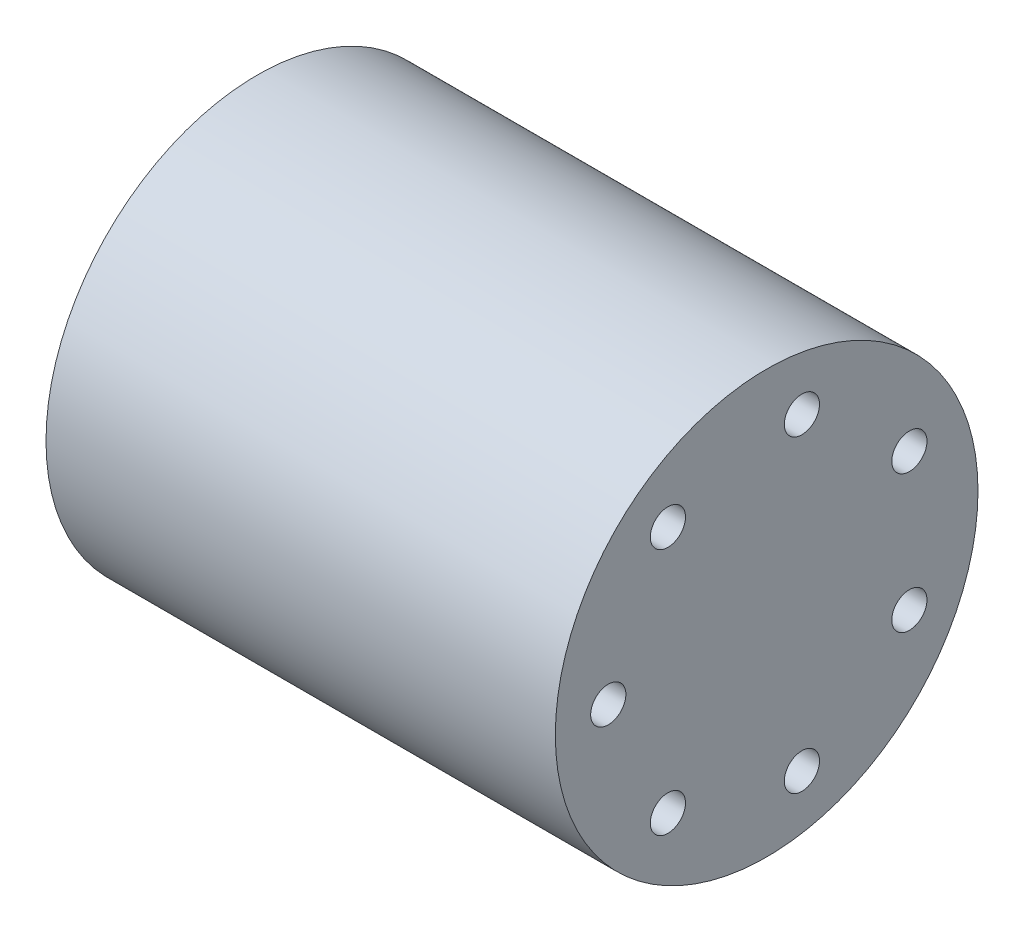
ISO-10303-21;
HEADER;
FILE_DESCRIPTION(('STEP AP214'),'2;1');
FILE_NAME('part.step','',(''),(''),'','','');
FILE_SCHEMA(('AUTOMOTIVE_DESIGN { 1 0 10303 214 1 1 1 1 }'));
ENDSEC;
DATA;
#1=APPLICATION_CONTEXT('core data for automotive mechanical design processes');
#2=APPLICATION_PROTOCOL_DEFINITION('international standard','automotive_design',2000,#1);
#3=PRODUCT_CONTEXT('',#1,'mechanical');
#4=PRODUCT('Part','Part','',(#3));
#5=PRODUCT_RELATED_PRODUCT_CATEGORY('part','',(#4));
#6=PRODUCT_DEFINITION_FORMATION('','',#4);
#7=PRODUCT_DEFINITION_CONTEXT('part definition',#1,'design');
#8=PRODUCT_DEFINITION('design','',#6,#7);
#9=PRODUCT_DEFINITION_SHAPE('','',#8);
#10=(LENGTH_UNIT() NAMED_UNIT(*) SI_UNIT(.MILLI.,.METRE.));
#11=(NAMED_UNIT(*) PLANE_ANGLE_UNIT() SI_UNIT($,.RADIAN.));
#12=(NAMED_UNIT(*) SI_UNIT($,.STERADIAN.) SOLID_ANGLE_UNIT());
#13=UNCERTAINTY_MEASURE_WITH_UNIT(LENGTH_MEASURE(1.E-05),#10,'distance_accuracy_value','');
#14=(GEOMETRIC_REPRESENTATION_CONTEXT(3) GLOBAL_UNCERTAINTY_ASSIGNED_CONTEXT((#13)) GLOBAL_UNIT_ASSIGNED_CONTEXT((#10,
#11,#12)) REPRESENTATION_CONTEXT('',''));
#15=CARTESIAN_POINT('',(0.,0.,0.));
#16=DIRECTION('',(0.,0.,1.));
#17=DIRECTION('',(1.,0.,0.));
#18=AXIS2_PLACEMENT_3D('',#15,#16,#17);
#19=CARTESIAN_POINT('',(6.0875,0.,0.));
#20=DIRECTION('',(1.,0.,0.));
#21=DIRECTION('',(0.,1.,0.));
#22=AXIS2_PLACEMENT_3D('',#19,#20,#21);
#23=PLANE('',#22);
#24=CARTESIAN_POINT('',(6.0875,-10.9679390120455,-2.50336050700853));
#25=DIRECTION('',(1.,0.,0.));
#26=DIRECTION('',(0.,0.,-1.));
#27=AXIS2_PLACEMENT_3D('',#24,#25,#26);
#28=CIRCLE('',#27,1.25);
#29=CARTESIAN_POINT('',(6.0875,-10.9679390120455,-3.75336050700853));
#30=VERTEX_POINT('',#29);
#31=EDGE_CURVE('E11',#30,#30,#28,.T.);
#32=ORIENTED_EDGE('',*,*,#31,.T.);
#33=EDGE_LOOP('',(#32));
#34=FACE_BOUND('',#33,.T.);
#35=ADVANCED_FACE('F16',(#34),#23,.T.);
#36=CARTESIAN_POINT('',(6.0875,-10.9679390120455,-2.50336050700853));
#37=DIRECTION('',(1.,0.,0.));
#38=DIRECTION('',(0.,0.,-1.));
#39=AXIS2_PLACEMENT_3D('',#36,#37,#38);
#40=CYLINDRICAL_SURFACE('',#39,1.25);
#41=CARTESIAN_POINT('',(18.0875,-10.9679390120455,-2.50336050700853));
#42=DIRECTION('',(1.,0.,0.));
#43=DIRECTION('',(0.,0.,-1.));
#44=AXIS2_PLACEMENT_3D('',#41,#42,#43);
#45=CIRCLE('',#44,1.25);
#46=CARTESIAN_POINT('',(18.0875,-10.9679390120455,-3.75336050700853));
#47=VERTEX_POINT('',#46);
#48=EDGE_CURVE('E20',#47,#47,#45,.T.);
#49=ORIENTED_EDGE('',*,*,#48,.T.);
#50=EDGE_LOOP('',(#49));
#51=FACE_BOUND('',#50,.T.);
#52=ORIENTED_EDGE('',*,*,#31,.F.);
#53=EDGE_LOOP('',(#52));
#54=FACE_BOUND('',#53,.T.);
#55=ADVANCED_FACE('F223',(#51,#54),#40,.F.);
#56=CARTESIAN_POINT('',(6.0875,0.,0.));
#57=DIRECTION('',(1.,0.,0.));
#58=DIRECTION('',(0.,1.,0.));
#59=AXIS2_PLACEMENT_3D('',#56,#57,#58);
#60=PLANE('',#59);
#61=CARTESIAN_POINT('',(6.0875,-4.88119206507253,-10.1358997639022));
#62=DIRECTION('',(1.,0.,0.));
#63=DIRECTION('',(0.,0.,-1.));
#64=AXIS2_PLACEMENT_3D('',#61,#62,#63);
#65=CIRCLE('',#64,1.25);
#66=CARTESIAN_POINT('',(6.0875,-4.88119206507253,-11.3858997639022));
#67=VERTEX_POINT('',#66);
#68=EDGE_CURVE('E27',#67,#67,#65,.T.);
#69=ORIENTED_EDGE('',*,*,#68,.T.);
#70=EDGE_LOOP('',(#69));
#71=FACE_BOUND('',#70,.T.);
#72=ADVANCED_FACE('F251',(#71),#60,.T.);
#73=CARTESIAN_POINT('',(6.0875,-4.88119206507253,-10.1358997639022));
#74=DIRECTION('',(1.,0.,0.));
#75=DIRECTION('',(0.,0.,-1.));
#76=AXIS2_PLACEMENT_3D('',#73,#74,#75);
#77=CYLINDRICAL_SURFACE('',#76,1.25);
#78=CARTESIAN_POINT('',(18.0875,-4.88119206507253,-10.1358997639022));
#79=DIRECTION('',(1.,0.,0.));
#80=DIRECTION('',(0.,0.,-1.));
#81=AXIS2_PLACEMENT_3D('',#78,#79,#80);
#82=CIRCLE('',#81,1.25);
#83=CARTESIAN_POINT('',(18.0875,-4.88119206507253,-11.3858997639022));
#84=VERTEX_POINT('',#83);
#85=EDGE_CURVE('E193',#84,#84,#82,.T.);
#86=ORIENTED_EDGE('',*,*,#85,.T.);
#87=EDGE_LOOP('',(#86));
#88=FACE_BOUND('',#87,.T.);
#89=ORIENTED_EDGE('',*,*,#68,.F.);
#90=EDGE_LOOP('',(#89));
#91=FACE_BOUND('',#90,.T.);
#92=ADVANCED_FACE('F280',(#88,#91),#77,.F.);
#93=CARTESIAN_POINT('',(6.0875,0.,0.));
#94=DIRECTION('',(1.,0.,0.));
#95=DIRECTION('',(0.,1.,0.));
#96=AXIS2_PLACEMENT_3D('',#93,#94,#95);
#97=PLANE('',#96);
#98=CARTESIAN_POINT('',(6.0875,4.88119206507253,-10.1358997639022));
#99=DIRECTION('',(1.,0.,0.));
#100=DIRECTION('',(0.,0.,-1.));
#101=AXIS2_PLACEMENT_3D('',#98,#99,#100);
#102=CIRCLE('',#101,1.25);
#103=CARTESIAN_POINT('',(6.0875,4.88119206507253,-11.3858997639022));
#104=VERTEX_POINT('',#103);
#105=EDGE_CURVE('E151',#104,#104,#102,.T.);
#106=ORIENTED_EDGE('',*,*,#105,.T.);
#107=EDGE_LOOP('',(#106));
#108=FACE_BOUND('',#107,.T.);
#109=ADVANCED_FACE('F301',(#108),#97,.T.);
#110=CARTESIAN_POINT('',(6.0875,4.88119206507253,-10.1358997639022));
#111=DIRECTION('',(1.,0.,0.));
#112=DIRECTION('',(0.,0.,-1.));
#113=AXIS2_PLACEMENT_3D('',#110,#111,#112);
#114=CYLINDRICAL_SURFACE('',#113,1.25);
#115=CARTESIAN_POINT('',(18.0875,4.88119206507253,-10.1358997639022));
#116=DIRECTION('',(1.,0.,0.));
#117=DIRECTION('',(0.,0.,-1.));
#118=AXIS2_PLACEMENT_3D('',#115,#116,#117);
#119=CIRCLE('',#118,1.25);
#120=CARTESIAN_POINT('',(18.0875,4.88119206507253,-11.3858997639022));
#121=VERTEX_POINT('',#120);
#122=EDGE_CURVE('E181',#121,#121,#119,.T.);
#123=ORIENTED_EDGE('',*,*,#122,.T.);
#124=EDGE_LOOP('',(#123));
#125=FACE_BOUND('',#124,.T.);
#126=ORIENTED_EDGE('',*,*,#105,.F.);
#127=EDGE_LOOP('',(#126));
#128=FACE_BOUND('',#127,.T.);
#129=ADVANCED_FACE('F259',(#125,#128),#114,.F.);
#130=CARTESIAN_POINT('',(6.0875,0.,0.));
#131=DIRECTION('',(1.,0.,0.));
#132=DIRECTION('',(0.,1.,0.));
#133=AXIS2_PLACEMENT_3D('',#130,#131,#132);
#134=PLANE('',#133);
#135=CARTESIAN_POINT('',(6.0875,10.9679390120455,-2.50336050700854));
#136=DIRECTION('',(1.,0.,0.));
#137=DIRECTION('',(0.,0.,-1.));
#138=AXIS2_PLACEMENT_3D('',#135,#136,#137);
#139=CIRCLE('',#138,1.25);
#140=CARTESIAN_POINT('',(6.0875,10.9679390120455,-3.75336050700854));
#141=VERTEX_POINT('',#140);
#142=EDGE_CURVE('E72',#141,#141,#139,.T.);
#143=ORIENTED_EDGE('',*,*,#142,.T.);
#144=EDGE_LOOP('',(#143));
#145=FACE_BOUND('',#144,.T.);
#146=ADVANCED_FACE('F255',(#145),#134,.T.);
#147=CARTESIAN_POINT('',(6.0875,10.9679390120455,-2.50336050700854));
#148=DIRECTION('',(1.,0.,0.));
#149=DIRECTION('',(0.,0.,-1.));
#150=AXIS2_PLACEMENT_3D('',#147,#148,#149);
#151=CYLINDRICAL_SURFACE('',#150,1.25);
#152=CARTESIAN_POINT('',(18.0875,10.9679390120455,-2.50336050700854));
#153=DIRECTION('',(1.,0.,0.));
#154=DIRECTION('',(0.,0.,-1.));
#155=AXIS2_PLACEMENT_3D('',#152,#153,#154);
#156=CIRCLE('',#155,1.25);
#157=CARTESIAN_POINT('',(18.0875,10.9679390120455,-3.75336050700854));
#158=VERTEX_POINT('',#157);
#159=EDGE_CURVE('E132',#158,#158,#156,.T.);
#160=ORIENTED_EDGE('',*,*,#159,.T.);
#161=EDGE_LOOP('',(#160));
#162=FACE_BOUND('',#161,.T.);
#163=ORIENTED_EDGE('',*,*,#142,.F.);
#164=EDGE_LOOP('',(#163));
#165=FACE_BOUND('',#164,.T.);
#166=ADVANCED_FACE('F258',(#162,#165),#151,.F.);
#167=CARTESIAN_POINT('',(6.0875,0.,0.));
#168=DIRECTION('',(1.,0.,0.));
#169=DIRECTION('',(0.,1.,0.));
#170=AXIS2_PLACEMENT_3D('',#167,#168,#169);
#171=PLANE('',#170);
#172=CARTESIAN_POINT('',(6.0875,8.79560417776534,7.01426027091075));
#173=DIRECTION('',(1.,0.,0.));
#174=DIRECTION('',(0.,0.,-1.));
#175=AXIS2_PLACEMENT_3D('',#172,#173,#174);
#176=CIRCLE('',#175,1.25);
#177=CARTESIAN_POINT('',(6.0875,8.79560417776534,5.76426027091075));
#178=VERTEX_POINT('',#177);
#179=EDGE_CURVE('E78',#178,#178,#176,.T.);
#180=ORIENTED_EDGE('',*,*,#179,.T.);
#181=EDGE_LOOP('',(#180));
#182=FACE_BOUND('',#181,.T.);
#183=ADVANCED_FACE('F18',(#182),#171,.T.);
#184=CARTESIAN_POINT('',(6.0875,8.79560417776534,7.01426027091075));
#185=DIRECTION('',(1.,0.,0.));
#186=DIRECTION('',(0.,0.,-1.));
#187=AXIS2_PLACEMENT_3D('',#184,#185,#186);
#188=CYLINDRICAL_SURFACE('',#187,1.25);
#189=CARTESIAN_POINT('',(18.0875,8.79560417776534,7.01426027091075));
#190=DIRECTION('',(1.,0.,0.));
#191=DIRECTION('',(0.,0.,-1.));
#192=AXIS2_PLACEMENT_3D('',#189,#190,#191);
#193=CIRCLE('',#192,1.25);
#194=CARTESIAN_POINT('',(18.0875,8.79560417776534,5.76426027091075));
#195=VERTEX_POINT('',#194);
#196=EDGE_CURVE('E123',#195,#195,#193,.T.);
#197=ORIENTED_EDGE('',*,*,#196,.T.);
#198=EDGE_LOOP('',(#197));
#199=FACE_BOUND('',#198,.T.);
#200=ORIENTED_EDGE('',*,*,#179,.F.);
#201=EDGE_LOOP('',(#200));
#202=FACE_BOUND('',#201,.T.);
#203=ADVANCED_FACE('F298',(#199,#202),#188,.F.);
#204=CARTESIAN_POINT('',(6.0875,0.,0.));
#205=DIRECTION('',(1.,0.,0.));
#206=DIRECTION('',(0.,1.,0.));
#207=AXIS2_PLACEMENT_3D('',#204,#205,#206);
#208=PLANE('',#207);
#209=CARTESIAN_POINT('',(6.0875,0.,11.25));
#210=DIRECTION('',(1.,0.,0.));
#211=DIRECTION('',(0.,0.,-1.));
#212=AXIS2_PLACEMENT_3D('',#209,#210,#211);
#213=CIRCLE('',#212,1.25);
#214=CARTESIAN_POINT('',(6.0875,0.,10.));
#215=VERTEX_POINT('',#214);
#216=EDGE_CURVE('E87',#215,#215,#213,.T.);
#217=ORIENTED_EDGE('',*,*,#216,.T.);
#218=EDGE_LOOP('',(#217));
#219=FACE_BOUND('',#218,.T.);
#220=ADVANCED_FACE('F295',(#219),#208,.T.);
#221=CARTESIAN_POINT('',(6.0875,0.,11.25));
#222=DIRECTION('',(1.,0.,0.));
#223=DIRECTION('',(0.,0.,-1.));
#224=AXIS2_PLACEMENT_3D('',#221,#222,#223);
#225=CYLINDRICAL_SURFACE('',#224,1.25);
#226=CARTESIAN_POINT('',(18.0875,0.,11.25));
#227=DIRECTION('',(1.,0.,0.));
#228=DIRECTION('',(0.,0.,-1.));
#229=AXIS2_PLACEMENT_3D('',#226,#227,#228);
#230=CIRCLE('',#229,1.25);
#231=CARTESIAN_POINT('',(18.0875,0.,10.));
#232=VERTEX_POINT('',#231);
#233=EDGE_CURVE('E118',#232,#232,#230,.T.);
#234=ORIENTED_EDGE('',*,*,#233,.T.);
#235=EDGE_LOOP('',(#234));
#236=FACE_BOUND('',#235,.T.);
#237=ORIENTED_EDGE('',*,*,#216,.F.);
#238=EDGE_LOOP('',(#237));
#239=FACE_BOUND('',#238,.T.);
#240=ADVANCED_FACE('F119',(#236,#239),#225,.F.);
#241=CARTESIAN_POINT('',(6.0875,0.,0.));
#242=DIRECTION('',(1.,0.,0.));
#243=DIRECTION('',(0.,1.,0.));
#244=AXIS2_PLACEMENT_3D('',#241,#242,#243);
#245=PLANE('',#244);
#246=CARTESIAN_POINT('',(6.0875,-8.79560417776534,7.01426027091075));
#247=DIRECTION('',(1.,0.,0.));
#248=DIRECTION('',(0.,0.,-1.));
#249=AXIS2_PLACEMENT_3D('',#246,#247,#248);
#250=CIRCLE('',#249,1.25);
#251=CARTESIAN_POINT('',(6.0875,-8.79560417776534,5.76426027091075));
#252=VERTEX_POINT('',#251);
#253=EDGE_CURVE('E129',#252,#252,#250,.T.);
#254=ORIENTED_EDGE('',*,*,#253,.T.);
#255=EDGE_LOOP('',(#254));
#256=FACE_BOUND('',#255,.T.);
#257=ADVANCED_FACE('F277',(#256),#245,.T.);
#258=CARTESIAN_POINT('',(6.0875,-8.79560417776534,7.01426027091075));
#259=DIRECTION('',(1.,0.,0.));
#260=DIRECTION('',(0.,0.,-1.));
#261=AXIS2_PLACEMENT_3D('',#258,#259,#260);
#262=CYLINDRICAL_SURFACE('',#261,1.25);
#263=CARTESIAN_POINT('',(18.0875,-8.79560417776534,7.01426027091075));
#264=DIRECTION('',(1.,0.,0.));
#265=DIRECTION('',(0.,0.,-1.));
#266=AXIS2_PLACEMENT_3D('',#263,#264,#265);
#267=CIRCLE('',#266,1.25);
#268=CARTESIAN_POINT('',(18.0875,-8.79560417776534,5.76426027091075));
#269=VERTEX_POINT('',#268);
#270=EDGE_CURVE('E112',#269,#269,#267,.T.);
#271=ORIENTED_EDGE('',*,*,#270,.T.);
#272=EDGE_LOOP('',(#271));
#273=FACE_BOUND('',#272,.T.);
#274=ORIENTED_EDGE('',*,*,#253,.F.);
#275=EDGE_LOOP('',(#274));
#276=FACE_BOUND('',#275,.T.);
#277=ADVANCED_FACE('F241',(#273,#276),#262,.F.);
#278=CARTESIAN_POINT('',(-18.0875,0.,0.));
#279=DIRECTION('',(1.,0.,0.));
#280=DIRECTION('',(0.,1.,0.));
#281=AXIS2_PLACEMENT_3D('',#278,#279,#280);
#282=PLANE('',#281);
#283=CARTESIAN_POINT('',(-18.0875,0.,0.));
#284=DIRECTION('',(1.,0.,0.));
#285=DIRECTION('',(0.,0.,-1.));
#286=AXIS2_PLACEMENT_3D('',#283,#284,#285);
#287=CIRCLE('',#286,15.01);
#288=CARTESIAN_POINT('',(-18.0875,0.,-15.01));
#289=VERTEX_POINT('',#288);
#290=EDGE_CURVE('E203',#289,#289,#287,.T.);
#291=ORIENTED_EDGE('',*,*,#290,.F.);
#292=EDGE_LOOP('',(#291));
#293=FACE_BOUND('',#292,.T.);
#294=CARTESIAN_POINT('',(-18.0875,-10.9679390120455,-2.50336050700853));
#295=DIRECTION('',(1.,0.,0.));
#296=DIRECTION('',(0.,0.,-1.));
#297=AXIS2_PLACEMENT_3D('',#294,#295,#296);
#298=CIRCLE('',#297,1.25);
#299=CARTESIAN_POINT('',(-18.0875,-10.9679390120455,-3.75336050700853));
#300=VERTEX_POINT('',#299);
#301=EDGE_CURVE('E188',#300,#300,#298,.T.);
#302=ORIENTED_EDGE('',*,*,#301,.T.);
#303=EDGE_LOOP('',(#302));
#304=FACE_BOUND('',#303,.T.);
#305=CARTESIAN_POINT('',(-18.0875,-4.88119206507253,-10.1358997639022));
#306=DIRECTION('',(1.,0.,0.));
#307=DIRECTION('',(0.,0.,-1.));
#308=AXIS2_PLACEMENT_3D('',#305,#306,#307);
#309=CIRCLE('',#308,1.25);
#310=CARTESIAN_POINT('',(-18.0875,-4.88119206507253,-11.3858997639022));
#311=VERTEX_POINT('',#310);
#312=EDGE_CURVE('E164',#311,#311,#309,.T.);
#313=ORIENTED_EDGE('',*,*,#312,.T.);
#314=EDGE_LOOP('',(#313));
#315=FACE_BOUND('',#314,.T.);
#316=CARTESIAN_POINT('',(-18.0875,4.88119206507253,-10.1358997639022));
#317=DIRECTION('',(1.,0.,0.));
#318=DIRECTION('',(0.,0.,-1.));
#319=AXIS2_PLACEMENT_3D('',#316,#317,#318);
#320=CIRCLE('',#319,1.25);
#321=CARTESIAN_POINT('',(-18.0875,4.88119206507253,-11.3858997639022));
#322=VERTEX_POINT('',#321);
#323=EDGE_CURVE('E182',#322,#322,#320,.T.);
#324=ORIENTED_EDGE('',*,*,#323,.T.);
#325=EDGE_LOOP('',(#324));
#326=FACE_BOUND('',#325,.T.);
#327=CARTESIAN_POINT('',(-18.0875,10.9679390120455,-2.50336050700854));
#328=DIRECTION('',(1.,0.,0.));
#329=DIRECTION('',(0.,0.,-1.));
#330=AXIS2_PLACEMENT_3D('',#327,#328,#329);
#331=CIRCLE('',#330,1.25);
#332=CARTESIAN_POINT('',(-18.0875,10.9679390120455,-3.75336050700854));
#333=VERTEX_POINT('',#332);
#334=EDGE_CURVE('E156',#333,#333,#331,.T.);
#335=ORIENTED_EDGE('',*,*,#334,.T.);
#336=EDGE_LOOP('',(#335));
#337=FACE_BOUND('',#336,.T.);
#338=CARTESIAN_POINT('',(-18.0875,8.79560417776534,7.01426027091075));
#339=DIRECTION('',(1.,0.,0.));
#340=DIRECTION('',(0.,0.,-1.));
#341=AXIS2_PLACEMENT_3D('',#338,#339,#340);
#342=CIRCLE('',#341,1.25);
#343=CARTESIAN_POINT('',(-18.0875,8.79560417776534,5.76426027091075));
#344=VERTEX_POINT('',#343);
#345=EDGE_CURVE('E155',#344,#344,#342,.T.);
#346=ORIENTED_EDGE('',*,*,#345,.T.);
#347=EDGE_LOOP('',(#346));
#348=FACE_BOUND('',#347,.T.);
#349=CARTESIAN_POINT('',(-18.0875,0.,11.25));
#350=DIRECTION('',(1.,0.,0.));
#351=DIRECTION('',(0.,0.,-1.));
#352=AXIS2_PLACEMENT_3D('',#349,#350,#351);
#353=CIRCLE('',#352,1.25);
#354=CARTESIAN_POINT('',(-18.0875,0.,10.));
#355=VERTEX_POINT('',#354);
#356=EDGE_CURVE('E144',#355,#355,#353,.T.);
#357=ORIENTED_EDGE('',*,*,#356,.T.);
#358=EDGE_LOOP('',(#357));
#359=FACE_BOUND('',#358,.T.);
#360=CARTESIAN_POINT('',(-18.0875,-8.79560417776534,7.01426027091075));
#361=DIRECTION('',(1.,0.,0.));
#362=DIRECTION('',(0.,0.,-1.));
#363=AXIS2_PLACEMENT_3D('',#360,#361,#362);
#364=CIRCLE('',#363,1.25);
#365=CARTESIAN_POINT('',(-18.0875,-8.79560417776534,5.76426027091075));
#366=VERTEX_POINT('',#365);
#367=EDGE_CURVE('E143',#366,#366,#364,.T.);
#368=ORIENTED_EDGE('',*,*,#367,.T.);
#369=EDGE_LOOP('',(#368));
#370=FACE_BOUND('',#369,.T.);
#371=ADVANCED_FACE('F232',(#293,#304,#315,#326,#337,#348,#359,#370),#282,.F.);
#372=CARTESIAN_POINT('',(18.0875,0.,0.));
#373=DIRECTION('',(1.,0.,0.));
#374=DIRECTION('',(0.,1.,0.));
#375=AXIS2_PLACEMENT_3D('',#372,#373,#374);
#376=PLANE('',#375);
#377=CARTESIAN_POINT('',(18.0875,0.,0.));
#378=DIRECTION('',(1.,0.,0.));
#379=DIRECTION('',(0.,0.,-1.));
#380=AXIS2_PLACEMENT_3D('',#377,#378,#379);
#381=CIRCLE('',#380,15.01);
#382=CARTESIAN_POINT('',(18.0875,0.,-15.01));
#383=VERTEX_POINT('',#382);
#384=EDGE_CURVE('E177',#383,#383,#381,.T.);
#385=ORIENTED_EDGE('',*,*,#384,.T.);
#386=EDGE_LOOP('',(#385));
#387=FACE_BOUND('',#386,.T.);
#388=ORIENTED_EDGE('',*,*,#270,.F.);
#389=EDGE_LOOP('',(#388));
#390=FACE_BOUND('',#389,.T.);
#391=ORIENTED_EDGE('',*,*,#233,.F.);
#392=EDGE_LOOP('',(#391));
#393=FACE_BOUND('',#392,.T.);
#394=ORIENTED_EDGE('',*,*,#196,.F.);
#395=EDGE_LOOP('',(#394));
#396=FACE_BOUND('',#395,.T.);
#397=ORIENTED_EDGE('',*,*,#159,.F.);
#398=EDGE_LOOP('',(#397));
#399=FACE_BOUND('',#398,.T.);
#400=ORIENTED_EDGE('',*,*,#122,.F.);
#401=EDGE_LOOP('',(#400));
#402=FACE_BOUND('',#401,.T.);
#403=ORIENTED_EDGE('',*,*,#85,.F.);
#404=EDGE_LOOP('',(#403));
#405=FACE_BOUND('',#404,.T.);
#406=ORIENTED_EDGE('',*,*,#48,.F.);
#407=EDGE_LOOP('',(#406));
#408=FACE_BOUND('',#407,.T.);
#409=ADVANCED_FACE('F229',(#387,#390,#393,#396,#399,#402,#405,#408),#376,.T.);
#410=CARTESIAN_POINT('',(18.0875,0.,0.));
#411=DIRECTION('',(-1.,0.,0.));
#412=DIRECTION('',(0.,0.,1.));
#413=AXIS2_PLACEMENT_3D('',#410,#411,#412);
#414=CYLINDRICAL_SURFACE('',#413,15.01);
#415=ORIENTED_EDGE('',*,*,#290,.T.);
#416=EDGE_LOOP('',(#415));
#417=FACE_BOUND('',#416,.T.);
#418=ORIENTED_EDGE('',*,*,#384,.F.);
#419=EDGE_LOOP('',(#418));
#420=FACE_BOUND('',#419,.T.);
#421=ADVANCED_FACE('F231',(#417,#420),#414,.T.);
#422=CARTESIAN_POINT('',(-6.0875,0.,0.));
#423=DIRECTION('',(-1.,0.,0.));
#424=DIRECTION('',(0.,0.,1.));
#425=AXIS2_PLACEMENT_3D('',#422,#423,#424);
#426=PLANE('',#425);
#427=CARTESIAN_POINT('',(-6.0875,-8.79560417776534,7.01426027091075));
#428=DIRECTION('',(1.,0.,0.));
#429=DIRECTION('',(0.,0.,-1.));
#430=AXIS2_PLACEMENT_3D('',#427,#428,#429);
#431=CIRCLE('',#430,1.25);
#432=CARTESIAN_POINT('',(-6.0875,-8.79560417776534,5.76426027091075));
#433=VERTEX_POINT('',#432);
#434=EDGE_CURVE('E139',#433,#433,#431,.T.);
#435=ORIENTED_EDGE('',*,*,#434,.F.);
#436=EDGE_LOOP('',(#435));
#437=FACE_BOUND('',#436,.T.);
#438=ADVANCED_FACE('F239',(#437),#426,.T.);
#439=CARTESIAN_POINT('',(-6.0875,-8.79560417776534,7.01426027091075));
#440=DIRECTION('',(-1.,0.,0.));
#441=DIRECTION('',(0.,0.,-1.));
#442=AXIS2_PLACEMENT_3D('',#439,#440,#441);
#443=CYLINDRICAL_SURFACE('',#442,1.25);
#444=ORIENTED_EDGE('',*,*,#367,.F.);
#445=EDGE_LOOP('',(#444));
#446=FACE_BOUND('',#445,.T.);
#447=ORIENTED_EDGE('',*,*,#434,.T.);
#448=EDGE_LOOP('',(#447));
#449=FACE_BOUND('',#448,.T.);
#450=ADVANCED_FACE('F263',(#446,#449),#443,.F.);
#451=CARTESIAN_POINT('',(-6.0875,0.,0.));
#452=DIRECTION('',(-1.,0.,0.));
#453=DIRECTION('',(0.,0.,1.));
#454=AXIS2_PLACEMENT_3D('',#451,#452,#453);
#455=PLANE('',#454);
#456=CARTESIAN_POINT('',(-6.0875,0.,11.25));
#457=DIRECTION('',(1.,0.,0.));
#458=DIRECTION('',(0.,0.,-1.));
#459=AXIS2_PLACEMENT_3D('',#456,#457,#458);
#460=CIRCLE('',#459,1.25);
#461=CARTESIAN_POINT('',(-6.0875,0.,10.));
#462=VERTEX_POINT('',#461);
#463=EDGE_CURVE('E148',#462,#462,#460,.T.);
#464=ORIENTED_EDGE('',*,*,#463,.F.);
#465=EDGE_LOOP('',(#464));
#466=FACE_BOUND('',#465,.T.);
#467=ADVANCED_FACE('F260',(#466),#455,.T.);
#468=CARTESIAN_POINT('',(-6.0875,0.,11.25));
#469=DIRECTION('',(-1.,0.,0.));
#470=DIRECTION('',(0.,0.,-1.));
#471=AXIS2_PLACEMENT_3D('',#468,#469,#470);
#472=CYLINDRICAL_SURFACE('',#471,1.25);
#473=ORIENTED_EDGE('',*,*,#356,.F.);
#474=EDGE_LOOP('',(#473));
#475=FACE_BOUND('',#474,.T.);
#476=ORIENTED_EDGE('',*,*,#463,.T.);
#477=EDGE_LOOP('',(#476));
#478=FACE_BOUND('',#477,.T.);
#479=ADVANCED_FACE('F262',(#475,#478),#472,.F.);
#480=CARTESIAN_POINT('',(-6.0875,0.,0.));
#481=DIRECTION('',(-1.,0.,0.));
#482=DIRECTION('',(0.,0.,1.));
#483=AXIS2_PLACEMENT_3D('',#480,#481,#482);
#484=PLANE('',#483);
#485=CARTESIAN_POINT('',(-6.0875,8.79560417776534,7.01426027091075));
#486=DIRECTION('',(1.,0.,0.));
#487=DIRECTION('',(0.,0.,-1.));
#488=AXIS2_PLACEMENT_3D('',#485,#486,#487);
#489=CIRCLE('',#488,1.25);
#490=CARTESIAN_POINT('',(-6.0875,8.79560417776534,5.76426027091075));
#491=VERTEX_POINT('',#490);
#492=EDGE_CURVE('E152',#491,#491,#489,.T.);
#493=ORIENTED_EDGE('',*,*,#492,.F.);
#494=EDGE_LOOP('',(#493));
#495=FACE_BOUND('',#494,.T.);
#496=ADVANCED_FACE('F311',(#495),#484,.T.);
#497=CARTESIAN_POINT('',(-6.0875,8.79560417776534,7.01426027091075));
#498=DIRECTION('',(-1.,0.,0.));
#499=DIRECTION('',(0.,0.,-1.));
#500=AXIS2_PLACEMENT_3D('',#497,#498,#499);
#501=CYLINDRICAL_SURFACE('',#500,1.25);
#502=ORIENTED_EDGE('',*,*,#345,.F.);
#503=EDGE_LOOP('',(#502));
#504=FACE_BOUND('',#503,.T.);
#505=ORIENTED_EDGE('',*,*,#492,.T.);
#506=EDGE_LOOP('',(#505));
#507=FACE_BOUND('',#506,.T.);
#508=ADVANCED_FACE('F305',(#504,#507),#501,.F.);
#509=CARTESIAN_POINT('',(-6.0875,0.,0.));
#510=DIRECTION('',(-1.,0.,0.));
#511=DIRECTION('',(0.,0.,1.));
#512=AXIS2_PLACEMENT_3D('',#509,#510,#511);
#513=PLANE('',#512);
#514=CARTESIAN_POINT('',(-6.0875,10.9679390120455,-2.50336050700854));
#515=DIRECTION('',(1.,0.,0.));
#516=DIRECTION('',(0.,0.,-1.));
#517=AXIS2_PLACEMENT_3D('',#514,#515,#516);
#518=CIRCLE('',#517,1.25);
#519=CARTESIAN_POINT('',(-6.0875,10.9679390120455,-3.75336050700854));
#520=VERTEX_POINT('',#519);
#521=EDGE_CURVE('E171',#520,#520,#518,.T.);
#522=ORIENTED_EDGE('',*,*,#521,.F.);
#523=EDGE_LOOP('',(#522));
#524=FACE_BOUND('',#523,.T.);
#525=ADVANCED_FACE('F270',(#524),#513,.T.);
#526=CARTESIAN_POINT('',(-6.0875,10.9679390120455,-2.50336050700854));
#527=DIRECTION('',(-1.,0.,0.));
#528=DIRECTION('',(0.,0.,-1.));
#529=AXIS2_PLACEMENT_3D('',#526,#527,#528);
#530=CYLINDRICAL_SURFACE('',#529,1.25);
#531=ORIENTED_EDGE('',*,*,#334,.F.);
#532=EDGE_LOOP('',(#531));
#533=FACE_BOUND('',#532,.T.);
#534=ORIENTED_EDGE('',*,*,#521,.T.);
#535=EDGE_LOOP('',(#534));
#536=FACE_BOUND('',#535,.T.);
#537=ADVANCED_FACE('F266',(#533,#536),#530,.F.);
#538=CARTESIAN_POINT('',(-6.0875,0.,0.));
#539=DIRECTION('',(-1.,0.,0.));
#540=DIRECTION('',(0.,0.,1.));
#541=AXIS2_PLACEMENT_3D('',#538,#539,#540);
#542=PLANE('',#541);
#543=CARTESIAN_POINT('',(-6.0875,4.88119206507253,-10.1358997639022));
#544=DIRECTION('',(1.,0.,0.));
#545=DIRECTION('',(0.,0.,-1.));
#546=AXIS2_PLACEMENT_3D('',#543,#544,#545);
#547=CIRCLE('',#546,1.25);
#548=CARTESIAN_POINT('',(-6.0875,4.88119206507253,-11.3858997639022));
#549=VERTEX_POINT('',#548);
#550=EDGE_CURVE('E136',#549,#549,#547,.T.);
#551=ORIENTED_EDGE('',*,*,#550,.F.);
#552=EDGE_LOOP('',(#551));
#553=FACE_BOUND('',#552,.T.);
#554=ADVANCED_FACE('F269',(#553),#542,.T.);
#555=CARTESIAN_POINT('',(-6.0875,4.88119206507253,-10.1358997639022));
#556=DIRECTION('',(-1.,0.,0.));
#557=DIRECTION('',(0.,0.,-1.));
#558=AXIS2_PLACEMENT_3D('',#555,#556,#557);
#559=CYLINDRICAL_SURFACE('',#558,1.25);
#560=ORIENTED_EDGE('',*,*,#323,.F.);
#561=EDGE_LOOP('',(#560));
#562=FACE_BOUND('',#561,.T.);
#563=ORIENTED_EDGE('',*,*,#550,.T.);
#564=EDGE_LOOP('',(#563));
#565=FACE_BOUND('',#564,.T.);
#566=ADVANCED_FACE('F323',(#562,#565),#559,.F.);
#567=CARTESIAN_POINT('',(-6.0875,0.,0.));
#568=DIRECTION('',(-1.,0.,0.));
#569=DIRECTION('',(0.,0.,1.));
#570=AXIS2_PLACEMENT_3D('',#567,#568,#569);
#571=PLANE('',#570);
#572=CARTESIAN_POINT('',(-6.0875,-4.88119206507253,-10.1358997639022));
#573=DIRECTION('',(1.,0.,0.));
#574=DIRECTION('',(0.,0.,-1.));
#575=AXIS2_PLACEMENT_3D('',#572,#573,#574);
#576=CIRCLE('',#575,1.25);
#577=CARTESIAN_POINT('',(-6.0875,-4.88119206507253,-11.3858997639022));
#578=VERTEX_POINT('',#577);
#579=EDGE_CURVE('E168',#578,#578,#576,.T.);
#580=ORIENTED_EDGE('',*,*,#579,.F.);
#581=EDGE_LOOP('',(#580));
#582=FACE_BOUND('',#581,.T.);
#583=ADVANCED_FACE('F293',(#582),#571,.T.);
#584=CARTESIAN_POINT('',(-6.0875,-4.88119206507253,-10.1358997639022));
#585=DIRECTION('',(-1.,0.,0.));
#586=DIRECTION('',(0.,0.,-1.));
#587=AXIS2_PLACEMENT_3D('',#584,#585,#586);
#588=CYLINDRICAL_SURFACE('',#587,1.25);
#589=ORIENTED_EDGE('',*,*,#312,.F.);
#590=EDGE_LOOP('',(#589));
#591=FACE_BOUND('',#590,.T.);
#592=ORIENTED_EDGE('',*,*,#579,.T.);
#593=EDGE_LOOP('',(#592));
#594=FACE_BOUND('',#593,.T.);
#595=ADVANCED_FACE('F286',(#591,#594),#588,.F.);
#596=CARTESIAN_POINT('',(-6.0875,0.,0.));
#597=DIRECTION('',(-1.,0.,0.));
#598=DIRECTION('',(0.,0.,1.));
#599=AXIS2_PLACEMENT_3D('',#596,#597,#598);
#600=PLANE('',#599);
#601=CARTESIAN_POINT('',(-6.0875,-10.9679390120455,-2.50336050700853));
#602=DIRECTION('',(1.,0.,0.));
#603=DIRECTION('',(0.,0.,-1.));
#604=AXIS2_PLACEMENT_3D('',#601,#602,#603);
#605=CIRCLE('',#604,1.25);
#606=CARTESIAN_POINT('',(-6.0875,-10.9679390120455,-3.75336050700853));
#607=VERTEX_POINT('',#606);
#608=EDGE_CURVE('E192',#607,#607,#605,.T.);
#609=ORIENTED_EDGE('',*,*,#608,.F.);
#610=EDGE_LOOP('',(#609));
#611=FACE_BOUND('',#610,.T.);
#612=ADVANCED_FACE('F282',(#611),#600,.T.);
#613=CARTESIAN_POINT('',(-6.0875,-10.9679390120455,-2.50336050700853));
#614=DIRECTION('',(-1.,0.,0.));
#615=DIRECTION('',(0.,0.,-1.));
#616=AXIS2_PLACEMENT_3D('',#613,#614,#615);
#617=CYLINDRICAL_SURFACE('',#616,1.25);
#618=ORIENTED_EDGE('',*,*,#301,.F.);
#619=EDGE_LOOP('',(#618));
#620=FACE_BOUND('',#619,.T.);
#621=ORIENTED_EDGE('',*,*,#608,.T.);
#622=EDGE_LOOP('',(#621));
#623=FACE_BOUND('',#622,.T.);
#624=ADVANCED_FACE('F285',(#620,#623),#617,.F.);
#625=CLOSED_SHELL('',(#35,#55,#72,#92,#109,#129,#146,#166,#183,#203,#220,#240,#257,#277,#371,
#409,#421,#438,#450,#467,#479,#496,#508,#525,#537,#554,#566,#583,#595,#612,#624));
#626=MANIFOLD_SOLID_BREP('B1',#625);
#627=ADVANCED_BREP_SHAPE_REPRESENTATION('',(#18,#626),#14);
#628=SHAPE_DEFINITION_REPRESENTATION(#9,#627);
ENDSEC;
END-ISO-10303-21;
